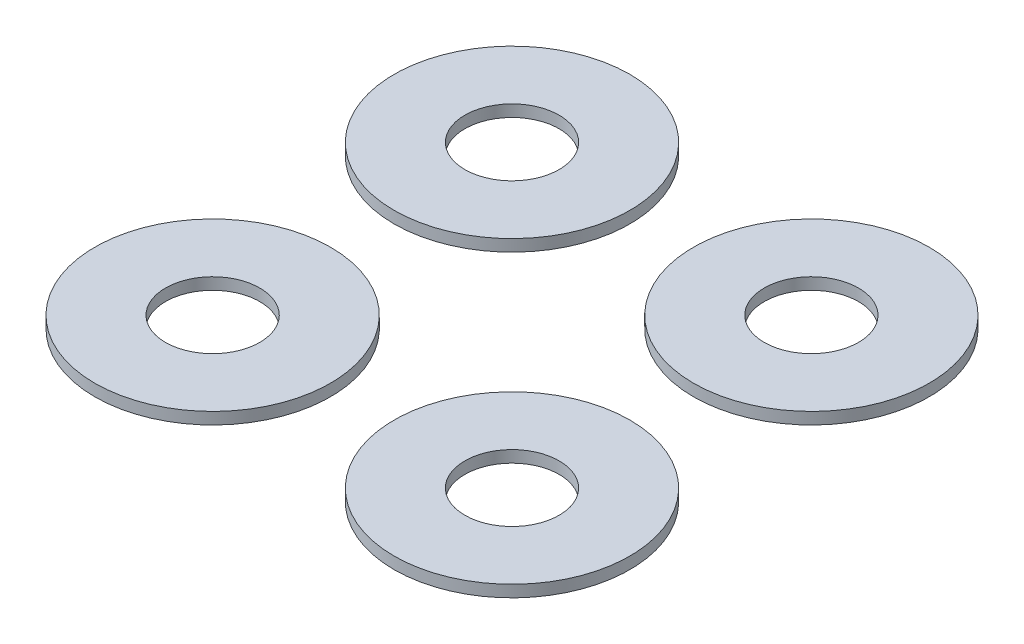
ISO-10303-21;
HEADER;
FILE_DESCRIPTION(('STEP AP214'),'2;1');
FILE_NAME('part.step','',(''),(''),'','','');
FILE_SCHEMA(('AUTOMOTIVE_DESIGN { 1 0 10303 214 1 1 1 1 }'));
ENDSEC;
DATA;
#1=APPLICATION_CONTEXT('core data for automotive mechanical design processes');
#2=APPLICATION_PROTOCOL_DEFINITION('international standard','automotive_design',2000,#1);
#3=PRODUCT_CONTEXT('',#1,'mechanical');
#4=PRODUCT('Part','Part','',(#3));
#5=PRODUCT_RELATED_PRODUCT_CATEGORY('part','',(#4));
#6=PRODUCT_DEFINITION_FORMATION('','',#4);
#7=PRODUCT_DEFINITION_CONTEXT('part definition',#1,'design');
#8=PRODUCT_DEFINITION('design','',#6,#7);
#9=PRODUCT_DEFINITION_SHAPE('','',#8);
#10=(LENGTH_UNIT() NAMED_UNIT(*) SI_UNIT(.MILLI.,.METRE.));
#11=(NAMED_UNIT(*) PLANE_ANGLE_UNIT() SI_UNIT($,.RADIAN.));
#12=(NAMED_UNIT(*) SI_UNIT($,.STERADIAN.) SOLID_ANGLE_UNIT());
#13=UNCERTAINTY_MEASURE_WITH_UNIT(LENGTH_MEASURE(1.E-05),#10,'distance_accuracy_value','');
#14=(GEOMETRIC_REPRESENTATION_CONTEXT(3) GLOBAL_UNCERTAINTY_ASSIGNED_CONTEXT((#13)) GLOBAL_UNIT_ASSIGNED_CONTEXT((#10,
#11,#12)) REPRESENTATION_CONTEXT('',''));
#15=CARTESIAN_POINT('',(0.,0.,0.));
#16=DIRECTION('',(0.,0.,1.));
#17=DIRECTION('',(1.,0.,0.));
#18=AXIS2_PLACEMENT_3D('',#15,#16,#17);
#19=CARTESIAN_POINT('',(2.54,0.1,0.));
#20=DIRECTION('',(0.,1.,0.));
#21=DIRECTION('',(0.,0.,1.));
#22=AXIS2_PLACEMENT_3D('',#19,#20,#21);
#23=PLANE('',#22);
#24=CARTESIAN_POINT('',(2.54,0.1,0.));
#25=DIRECTION('',(0.,1.,0.));
#26=DIRECTION('',(0.,0.,1.));
#27=AXIS2_PLACEMENT_3D('',#24,#25,#26);
#28=CIRCLE('',#27,1.);
#29=CARTESIAN_POINT('',(2.54,0.1,1.));
#30=VERTEX_POINT('',#29);
#31=EDGE_CURVE('E11',#30,#30,#28,.T.);
#32=ORIENTED_EDGE('',*,*,#31,.T.);
#33=EDGE_LOOP('',(#32));
#34=FACE_BOUND('',#33,.T.);
#35=CARTESIAN_POINT('',(2.54,0.1,0.));
#36=DIRECTION('',(0.,1.,0.));
#37=DIRECTION('',(0.,0.,1.));
#38=AXIS2_PLACEMENT_3D('',#35,#36,#37);
#39=CIRCLE('',#38,0.4);
#40=CARTESIAN_POINT('',(2.54,0.1,0.4));
#41=VERTEX_POINT('',#40);
#42=EDGE_CURVE('E53',#41,#41,#39,.T.);
#43=ORIENTED_EDGE('',*,*,#42,.F.);
#44=EDGE_LOOP('',(#43));
#45=FACE_BOUND('',#44,.T.);
#46=ADVANCED_FACE('F42',(#34,#45),#23,.T.);
#47=CARTESIAN_POINT('',(2.54,0.,0.));
#48=DIRECTION('',(0.,1.,0.));
#49=DIRECTION('',(0.,0.,1.));
#50=AXIS2_PLACEMENT_3D('',#47,#48,#49);
#51=PLANE('',#50);
#52=CARTESIAN_POINT('',(2.54,0.,0.));
#53=DIRECTION('',(0.,1.,0.));
#54=DIRECTION('',(0.,0.,1.));
#55=AXIS2_PLACEMENT_3D('',#52,#53,#54);
#56=CIRCLE('',#55,1.);
#57=CARTESIAN_POINT('',(2.54,0.,1.));
#58=VERTEX_POINT('',#57);
#59=EDGE_CURVE('E46',#58,#58,#56,.T.);
#60=ORIENTED_EDGE('',*,*,#59,.F.);
#61=EDGE_LOOP('',(#60));
#62=FACE_BOUND('',#61,.T.);
#63=CARTESIAN_POINT('',(2.54,0.,0.));
#64=DIRECTION('',(0.,1.,0.));
#65=DIRECTION('',(0.,0.,1.));
#66=AXIS2_PLACEMENT_3D('',#63,#64,#65);
#67=CIRCLE('',#66,0.4);
#68=CARTESIAN_POINT('',(2.54,0.,0.4));
#69=VERTEX_POINT('',#68);
#70=EDGE_CURVE('E55',#69,#69,#67,.T.);
#71=ORIENTED_EDGE('',*,*,#70,.T.);
#72=EDGE_LOOP('',(#71));
#73=FACE_BOUND('',#72,.T.);
#74=ADVANCED_FACE('F65',(#62,#73),#51,.F.);
#75=CARTESIAN_POINT('',(2.54,0.1,0.));
#76=DIRECTION('',(0.,-1.,0.));
#77=DIRECTION('',(0.,0.,-1.));
#78=AXIS2_PLACEMENT_3D('',#75,#76,#77);
#79=CYLINDRICAL_SURFACE('',#78,1.);
#80=ORIENTED_EDGE('',*,*,#31,.F.);
#81=EDGE_LOOP('',(#80));
#82=FACE_BOUND('',#81,.T.);
#83=ORIENTED_EDGE('',*,*,#59,.T.);
#84=EDGE_LOOP('',(#83));
#85=FACE_BOUND('',#84,.T.);
#86=ADVANCED_FACE('F44',(#82,#85),#79,.T.);
#87=CARTESIAN_POINT('',(2.54,0.1,0.));
#88=DIRECTION('',(0.,-1.,0.));
#89=DIRECTION('',(0.,0.,-1.));
#90=AXIS2_PLACEMENT_3D('',#87,#88,#89);
#91=CYLINDRICAL_SURFACE('',#90,0.4);
#92=ORIENTED_EDGE('',*,*,#42,.T.);
#93=EDGE_LOOP('',(#92));
#94=FACE_BOUND('',#93,.T.);
#95=ORIENTED_EDGE('',*,*,#70,.F.);
#96=EDGE_LOOP('',(#95));
#97=FACE_BOUND('',#96,.T.);
#98=ADVANCED_FACE('F61',(#94,#97),#91,.F.);
#99=CLOSED_SHELL('',(#46,#74,#86,#98));
#100=MANIFOLD_SOLID_BREP('B2',#99);
#101=CARTESIAN_POINT('',(2.54,0.1,-2.54));
#102=DIRECTION('',(0.,1.,0.));
#103=DIRECTION('',(0.,0.,1.));
#104=AXIS2_PLACEMENT_3D('',#101,#102,#103);
#105=PLANE('',#104);
#106=CARTESIAN_POINT('',(2.54,0.1,-2.54));
#107=DIRECTION('',(0.,1.,0.));
#108=DIRECTION('',(0.,0.,1.));
#109=AXIS2_PLACEMENT_3D('',#106,#107,#108);
#110=CIRCLE('',#109,1.);
#111=CARTESIAN_POINT('',(2.54,0.1,-1.54));
#112=VERTEX_POINT('',#111);
#113=EDGE_CURVE('E41',#112,#112,#110,.T.);
#114=ORIENTED_EDGE('',*,*,#113,.T.);
#115=EDGE_LOOP('',(#114));
#116=FACE_BOUND('',#115,.T.);
#117=CARTESIAN_POINT('',(2.54,0.1,-2.54));
#118=DIRECTION('',(0.,1.,0.));
#119=DIRECTION('',(0.,0.,1.));
#120=AXIS2_PLACEMENT_3D('',#117,#118,#119);
#121=CIRCLE('',#120,0.4);
#122=CARTESIAN_POINT('',(2.54,0.1,-2.14));
#123=VERTEX_POINT('',#122);
#124=EDGE_CURVE('E123',#123,#123,#121,.T.);
#125=ORIENTED_EDGE('',*,*,#124,.F.);
#126=EDGE_LOOP('',(#125));
#127=FACE_BOUND('',#126,.T.);
#128=ADVANCED_FACE('F112',(#116,#127),#105,.T.);
#129=CARTESIAN_POINT('',(2.54,0.,-2.54));
#130=DIRECTION('',(0.,1.,0.));
#131=DIRECTION('',(0.,0.,1.));
#132=AXIS2_PLACEMENT_3D('',#129,#130,#131);
#133=PLANE('',#132);
#134=CARTESIAN_POINT('',(2.54,0.,-2.54));
#135=DIRECTION('',(0.,1.,0.));
#136=DIRECTION('',(0.,0.,1.));
#137=AXIS2_PLACEMENT_3D('',#134,#135,#136);
#138=CIRCLE('',#137,1.);
#139=CARTESIAN_POINT('',(2.54,0.,-1.54));
#140=VERTEX_POINT('',#139);
#141=EDGE_CURVE('E116',#140,#140,#138,.T.);
#142=ORIENTED_EDGE('',*,*,#141,.F.);
#143=EDGE_LOOP('',(#142));
#144=FACE_BOUND('',#143,.T.);
#145=CARTESIAN_POINT('',(2.54,0.,-2.54));
#146=DIRECTION('',(0.,1.,0.));
#147=DIRECTION('',(0.,0.,1.));
#148=AXIS2_PLACEMENT_3D('',#145,#146,#147);
#149=CIRCLE('',#148,0.4);
#150=CARTESIAN_POINT('',(2.54,0.,-2.14));
#151=VERTEX_POINT('',#150);
#152=EDGE_CURVE('E125',#151,#151,#149,.T.);
#153=ORIENTED_EDGE('',*,*,#152,.T.);
#154=EDGE_LOOP('',(#153));
#155=FACE_BOUND('',#154,.T.);
#156=ADVANCED_FACE('F135',(#144,#155),#133,.F.);
#157=CARTESIAN_POINT('',(2.54,0.1,-2.54));
#158=DIRECTION('',(0.,-1.,0.));
#159=DIRECTION('',(0.,0.,-1.));
#160=AXIS2_PLACEMENT_3D('',#157,#158,#159);
#161=CYLINDRICAL_SURFACE('',#160,1.);
#162=ORIENTED_EDGE('',*,*,#113,.F.);
#163=EDGE_LOOP('',(#162));
#164=FACE_BOUND('',#163,.T.);
#165=ORIENTED_EDGE('',*,*,#141,.T.);
#166=EDGE_LOOP('',(#165));
#167=FACE_BOUND('',#166,.T.);
#168=ADVANCED_FACE('F114',(#164,#167),#161,.T.);
#169=CARTESIAN_POINT('',(2.54,0.1,-2.54));
#170=DIRECTION('',(0.,-1.,0.));
#171=DIRECTION('',(0.,0.,-1.));
#172=AXIS2_PLACEMENT_3D('',#169,#170,#171);
#173=CYLINDRICAL_SURFACE('',#172,0.4);
#174=ORIENTED_EDGE('',*,*,#124,.T.);
#175=EDGE_LOOP('',(#174));
#176=FACE_BOUND('',#175,.T.);
#177=ORIENTED_EDGE('',*,*,#152,.F.);
#178=EDGE_LOOP('',(#177));
#179=FACE_BOUND('',#178,.T.);
#180=ADVANCED_FACE('F131',(#176,#179),#173,.F.);
#181=CLOSED_SHELL('',(#128,#156,#168,#180));
#182=MANIFOLD_SOLID_BREP('B6',#181);
#183=CARTESIAN_POINT('',(0.,0.1,-2.54));
#184=DIRECTION('',(0.,1.,0.));
#185=DIRECTION('',(0.,0.,1.));
#186=AXIS2_PLACEMENT_3D('',#183,#184,#185);
#187=PLANE('',#186);
#188=CARTESIAN_POINT('',(0.,0.1,-2.54));
#189=DIRECTION('',(0.,1.,0.));
#190=DIRECTION('',(0.,0.,1.));
#191=AXIS2_PLACEMENT_3D('',#188,#189,#190);
#192=CIRCLE('',#191,1.);
#193=CARTESIAN_POINT('',(0.,0.1,-1.54));
#194=VERTEX_POINT('',#193);
#195=EDGE_CURVE('E111',#194,#194,#192,.T.);
#196=ORIENTED_EDGE('',*,*,#195,.T.);
#197=EDGE_LOOP('',(#196));
#198=FACE_BOUND('',#197,.T.);
#199=CARTESIAN_POINT('',(0.,0.1,-2.54));
#200=DIRECTION('',(0.,1.,0.));
#201=DIRECTION('',(0.,0.,1.));
#202=AXIS2_PLACEMENT_3D('',#199,#200,#201);
#203=CIRCLE('',#202,0.4);
#204=CARTESIAN_POINT('',(0.,0.1,-2.14));
#205=VERTEX_POINT('',#204);
#206=EDGE_CURVE('E192',#205,#205,#203,.T.);
#207=ORIENTED_EDGE('',*,*,#206,.F.);
#208=EDGE_LOOP('',(#207));
#209=FACE_BOUND('',#208,.T.);
#210=ADVANCED_FACE('F181',(#198,#209),#187,.T.);
#211=CARTESIAN_POINT('',(0.,0.,-2.54));
#212=DIRECTION('',(0.,1.,0.));
#213=DIRECTION('',(0.,0.,1.));
#214=AXIS2_PLACEMENT_3D('',#211,#212,#213);
#215=PLANE('',#214);
#216=CARTESIAN_POINT('',(0.,0.,-2.54));
#217=DIRECTION('',(0.,1.,0.));
#218=DIRECTION('',(0.,0.,1.));
#219=AXIS2_PLACEMENT_3D('',#216,#217,#218);
#220=CIRCLE('',#219,1.);
#221=CARTESIAN_POINT('',(0.,0.,-1.54));
#222=VERTEX_POINT('',#221);
#223=EDGE_CURVE('E185',#222,#222,#220,.T.);
#224=ORIENTED_EDGE('',*,*,#223,.F.);
#225=EDGE_LOOP('',(#224));
#226=FACE_BOUND('',#225,.T.);
#227=CARTESIAN_POINT('',(0.,0.,-2.54));
#228=DIRECTION('',(0.,1.,0.));
#229=DIRECTION('',(0.,0.,1.));
#230=AXIS2_PLACEMENT_3D('',#227,#228,#229);
#231=CIRCLE('',#230,0.4);
#232=CARTESIAN_POINT('',(0.,0.,-2.14));
#233=VERTEX_POINT('',#232);
#234=EDGE_CURVE('E194',#233,#233,#231,.T.);
#235=ORIENTED_EDGE('',*,*,#234,.T.);
#236=EDGE_LOOP('',(#235));
#237=FACE_BOUND('',#236,.T.);
#238=ADVANCED_FACE('F204',(#226,#237),#215,.F.);
#239=CARTESIAN_POINT('',(0.,0.1,-2.54));
#240=DIRECTION('',(0.,-1.,0.));
#241=DIRECTION('',(0.,0.,-1.));
#242=AXIS2_PLACEMENT_3D('',#239,#240,#241);
#243=CYLINDRICAL_SURFACE('',#242,1.);
#244=ORIENTED_EDGE('',*,*,#195,.F.);
#245=EDGE_LOOP('',(#244));
#246=FACE_BOUND('',#245,.T.);
#247=ORIENTED_EDGE('',*,*,#223,.T.);
#248=EDGE_LOOP('',(#247));
#249=FACE_BOUND('',#248,.T.);
#250=ADVANCED_FACE('F183',(#246,#249),#243,.T.);
#251=CARTESIAN_POINT('',(0.,0.1,-2.54));
#252=DIRECTION('',(0.,-1.,0.));
#253=DIRECTION('',(0.,0.,-1.));
#254=AXIS2_PLACEMENT_3D('',#251,#252,#253);
#255=CYLINDRICAL_SURFACE('',#254,0.4);
#256=ORIENTED_EDGE('',*,*,#206,.T.);
#257=EDGE_LOOP('',(#256));
#258=FACE_BOUND('',#257,.T.);
#259=ORIENTED_EDGE('',*,*,#234,.F.);
#260=EDGE_LOOP('',(#259));
#261=FACE_BOUND('',#260,.T.);
#262=ADVANCED_FACE('F200',(#258,#261),#255,.F.);
#263=CLOSED_SHELL('',(#210,#238,#250,#262));
#264=MANIFOLD_SOLID_BREP('B36',#263);
#265=CARTESIAN_POINT('',(0.,0.1,0.));
#266=DIRECTION('',(0.,1.,0.));
#267=DIRECTION('',(0.,0.,1.));
#268=AXIS2_PLACEMENT_3D('',#265,#266,#267);
#269=PLANE('',#268);
#270=CARTESIAN_POINT('',(0.,0.1,0.));
#271=DIRECTION('',(0.,1.,0.));
#272=DIRECTION('',(0.,0.,1.));
#273=AXIS2_PLACEMENT_3D('',#270,#271,#272);
#274=CIRCLE('',#273,1.);
#275=CARTESIAN_POINT('',(0.,0.1,1.));
#276=VERTEX_POINT('',#275);
#277=EDGE_CURVE('E180',#276,#276,#274,.T.);
#278=ORIENTED_EDGE('',*,*,#277,.T.);
#279=EDGE_LOOP('',(#278));
#280=FACE_BOUND('',#279,.T.);
#281=CARTESIAN_POINT('',(0.,0.1,0.));
#282=DIRECTION('',(0.,1.,0.));
#283=DIRECTION('',(0.,0.,1.));
#284=AXIS2_PLACEMENT_3D('',#281,#282,#283);
#285=CIRCLE('',#284,0.399999999999999);
#286=CARTESIAN_POINT('',(0.,0.1,0.399999999999999));
#287=VERTEX_POINT('',#286);
#288=EDGE_CURVE('E254',#287,#287,#285,.T.);
#289=ORIENTED_EDGE('',*,*,#288,.F.);
#290=EDGE_LOOP('',(#289));
#291=FACE_BOUND('',#290,.T.);
#292=ADVANCED_FACE('F243',(#280,#291),#269,.T.);
#293=CARTESIAN_POINT('',(0.,0.,0.));
#294=DIRECTION('',(0.,1.,0.));
#295=DIRECTION('',(0.,0.,1.));
#296=AXIS2_PLACEMENT_3D('',#293,#294,#295);
#297=PLANE('',#296);
#298=CARTESIAN_POINT('',(0.,0.,0.));
#299=DIRECTION('',(0.,1.,0.));
#300=DIRECTION('',(0.,0.,1.));
#301=AXIS2_PLACEMENT_3D('',#298,#299,#300);
#302=CIRCLE('',#301,1.);
#303=CARTESIAN_POINT('',(0.,0.,1.));
#304=VERTEX_POINT('',#303);
#305=EDGE_CURVE('E247',#304,#304,#302,.T.);
#306=ORIENTED_EDGE('',*,*,#305,.F.);
#307=EDGE_LOOP('',(#306));
#308=FACE_BOUND('',#307,.T.);
#309=CARTESIAN_POINT('',(0.,0.,0.));
#310=DIRECTION('',(0.,1.,0.));
#311=DIRECTION('',(0.,0.,1.));
#312=AXIS2_PLACEMENT_3D('',#309,#310,#311);
#313=CIRCLE('',#312,0.399999999999999);
#314=CARTESIAN_POINT('',(0.,0.,0.399999999999999));
#315=VERTEX_POINT('',#314);
#316=EDGE_CURVE('E256',#315,#315,#313,.T.);
#317=ORIENTED_EDGE('',*,*,#316,.T.);
#318=EDGE_LOOP('',(#317));
#319=FACE_BOUND('',#318,.T.);
#320=ADVANCED_FACE('F266',(#308,#319),#297,.F.);
#321=CARTESIAN_POINT('',(0.,0.1,0.));
#322=DIRECTION('',(0.,-1.,0.));
#323=DIRECTION('',(0.,0.,-1.));
#324=AXIS2_PLACEMENT_3D('',#321,#322,#323);
#325=CYLINDRICAL_SURFACE('',#324,1.);
#326=ORIENTED_EDGE('',*,*,#277,.F.);
#327=EDGE_LOOP('',(#326));
#328=FACE_BOUND('',#327,.T.);
#329=ORIENTED_EDGE('',*,*,#305,.T.);
#330=EDGE_LOOP('',(#329));
#331=FACE_BOUND('',#330,.T.);
#332=ADVANCED_FACE('F245',(#328,#331),#325,.T.);
#333=CARTESIAN_POINT('',(0.,0.1,0.));
#334=DIRECTION('',(0.,-1.,0.));
#335=DIRECTION('',(0.,0.,-1.));
#336=AXIS2_PLACEMENT_3D('',#333,#334,#335);
#337=CYLINDRICAL_SURFACE('',#336,0.399999999999999);
#338=ORIENTED_EDGE('',*,*,#288,.T.);
#339=EDGE_LOOP('',(#338));
#340=FACE_BOUND('',#339,.T.);
#341=ORIENTED_EDGE('',*,*,#316,.F.);
#342=EDGE_LOOP('',(#341));
#343=FACE_BOUND('',#342,.T.);
#344=ADVANCED_FACE('F262',(#340,#343),#337,.F.);
#345=CLOSED_SHELL('',(#292,#320,#332,#344));
#346=MANIFOLD_SOLID_BREP('B106',#345);
#347=ADVANCED_BREP_SHAPE_REPRESENTATION('',(#18,#100,#182,#264,#346),#14);
#348=SHAPE_DEFINITION_REPRESENTATION(#9,#347);
ENDSEC;
END-ISO-10303-21;
